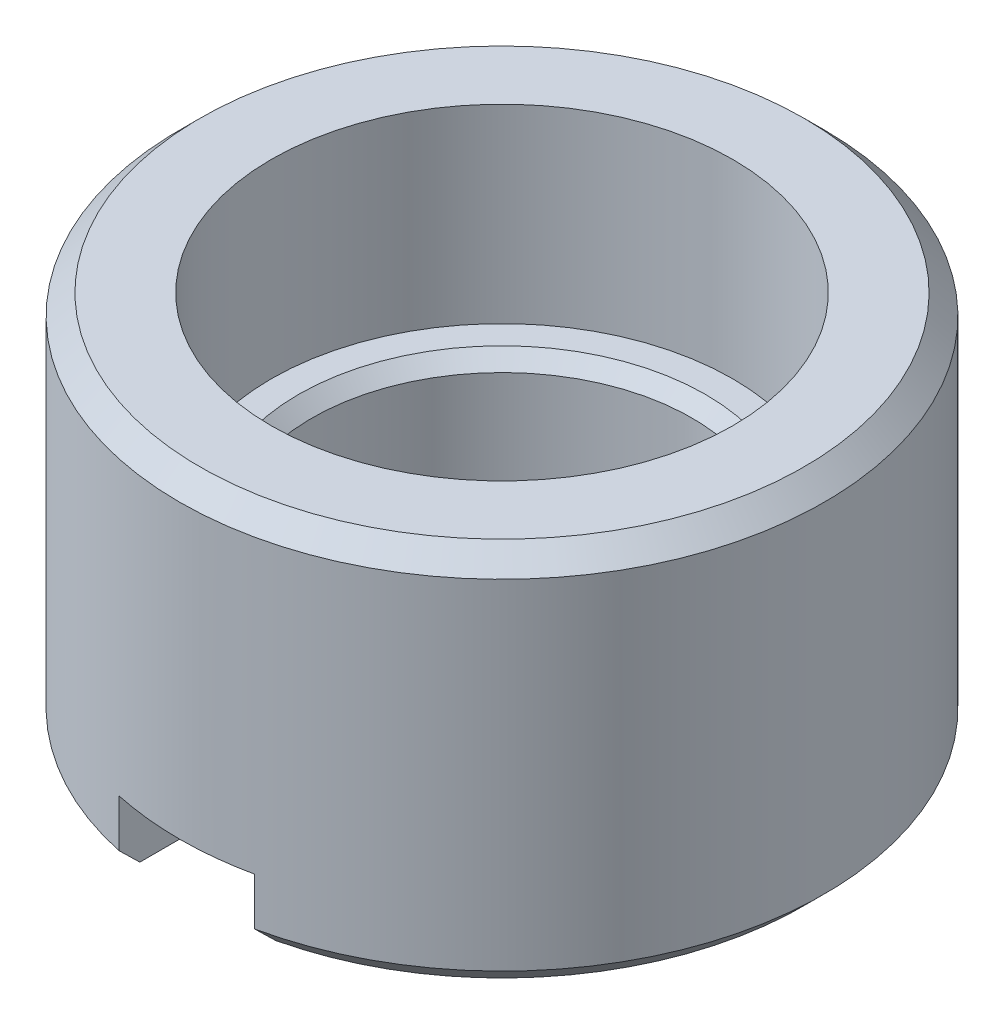
ISO-10303-21;
HEADER;
FILE_DESCRIPTION(('STEP AP214'),'2;1');
FILE_NAME('part.step','',(''),(''),'','','');
FILE_SCHEMA(('AUTOMOTIVE_DESIGN { 1 0 10303 214 1 1 1 1 }'));
ENDSEC;
DATA;
#1=APPLICATION_CONTEXT('core data for automotive mechanical design processes');
#2=APPLICATION_PROTOCOL_DEFINITION('international standard','automotive_design',2000,#1);
#3=PRODUCT_CONTEXT('',#1,'mechanical');
#4=PRODUCT('Part','Part','',(#3));
#5=PRODUCT_RELATED_PRODUCT_CATEGORY('part','',(#4));
#6=PRODUCT_DEFINITION_FORMATION('','',#4);
#7=PRODUCT_DEFINITION_CONTEXT('part definition',#1,'design');
#8=PRODUCT_DEFINITION('design','',#6,#7);
#9=PRODUCT_DEFINITION_SHAPE('','',#8);
#10=(LENGTH_UNIT() NAMED_UNIT(*) SI_UNIT(.MILLI.,.METRE.));
#11=(NAMED_UNIT(*) PLANE_ANGLE_UNIT() SI_UNIT($,.RADIAN.));
#12=(NAMED_UNIT(*) SI_UNIT($,.STERADIAN.) SOLID_ANGLE_UNIT());
#13=UNCERTAINTY_MEASURE_WITH_UNIT(LENGTH_MEASURE(1.E-05),#10,'distance_accuracy_value','');
#14=(GEOMETRIC_REPRESENTATION_CONTEXT(3) GLOBAL_UNCERTAINTY_ASSIGNED_CONTEXT((#13)) GLOBAL_UNIT_ASSIGNED_CONTEXT((#10,
#11,#12)) REPRESENTATION_CONTEXT('',''));
#15=CARTESIAN_POINT('',(0.,0.,0.));
#16=DIRECTION('',(0.,0.,1.));
#17=DIRECTION('',(1.,0.,0.));
#18=AXIS2_PLACEMENT_3D('',#15,#16,#17);
#19=CARTESIAN_POINT('',(0.,1.39999999993279,0.));
#20=DIRECTION('',(0.,1.,0.));
#21=DIRECTION('',(0.,0.,1.));
#22=AXIS2_PLACEMENT_3D('',#19,#20,#21);
#23=CONICAL_SURFACE('',#22,1.49999999990769,0.785398163397448);
#24=CARTESIAN_POINT('',(0.,1.39999999998963,0.));
#25=DIRECTION('',(0.,1.,0.));
#26=DIRECTION('',(0.,0.,1.));
#27=AXIS2_PLACEMENT_3D('',#24,#25,#26);
#28=CIRCLE('',#27,1.49999999996453);
#29=CARTESIAN_POINT('',(0.,1.39999999998963,1.49999999996453));
#30=VERTEX_POINT('',#29);
#31=EDGE_CURVE('E92',#30,#30,#28,.T.);
#32=ORIENTED_EDGE('',*,*,#31,.T.);
#33=EDGE_LOOP('',(#32));
#34=FACE_BOUND('',#33,.T.);
#35=CARTESIAN_POINT('',(0.,1.3,0.));
#36=DIRECTION('',(0.,1.,0.));
#37=DIRECTION('',(0.,0.,1.));
#38=AXIS2_PLACEMENT_3D('',#35,#36,#37);
#39=CIRCLE('',#38,1.4);
#40=CARTESIAN_POINT('',(0.,1.3,1.4));
#41=VERTEX_POINT('',#40);
#42=EDGE_CURVE('E89',#41,#41,#39,.F.);
#43=ORIENTED_EDGE('',*,*,#42,.T.);
#44=EDGE_LOOP('',(#43));
#45=FACE_BOUND('',#44,.T.);
#46=ADVANCED_FACE('F16',(#34,#45),#23,.F.);
#47=CARTESIAN_POINT('',(0.,0.,0.));
#48=DIRECTION('',(0.,1.,0.));
#49=DIRECTION('',(0.,0.,1.));
#50=AXIS2_PLACEMENT_3D('',#47,#48,#49);
#51=CYLINDRICAL_SURFACE('',#50,1.4);
#52=DIRECTION('',(0.,1.,0.));
#53=VECTOR('',#52,1.);
#54=CARTESIAN_POINT('',(-0.500000000000068,0.,1.30766968306218));
#55=LINE('',#54,#53);
#56=CARTESIAN_POINT('',(-0.500000000000034,0.15000000002292,1.30766968310323));
#57=VERTEX_POINT('',#56);
#58=CARTESIAN_POINT('',(-0.500000000000034,0.5,1.30766968306219));
#59=VERTEX_POINT('',#58);
#60=EDGE_CURVE('E65',#57,#59,#55,.T.);
#61=ORIENTED_EDGE('',*,*,#60,.F.);
#62=CARTESIAN_POINT('',(0.,0.15000000001919,0.));
#63=DIRECTION('',(0.,-1.,0.));
#64=DIRECTION('',(0.,0.,-1.));
#65=AXIS2_PLACEMENT_3D('',#62,#63,#64);
#66=CIRCLE('',#65,1.40000000010332);
#67=CARTESIAN_POINT('',(0.500000000000068,0.150000000061254,1.30766968306218));
#68=VERTEX_POINT('',#67);
#69=EDGE_CURVE('E88',#57,#68,#66,.T.);
#70=ORIENTED_EDGE('',*,*,#69,.T.);
#71=DIRECTION('',(0.,1.,0.));
#72=VECTOR('',#71,1.);
#73=CARTESIAN_POINT('',(0.500000000000068,0.,1.30766968306218));
#74=LINE('',#73,#72);
#75=CARTESIAN_POINT('',(0.500000000000034,0.5,1.30766968306219));
#76=VERTEX_POINT('',#75);
#77=EDGE_CURVE('E76',#76,#68,#74,.F.);
#78=ORIENTED_EDGE('',*,*,#77,.F.);
#79=CARTESIAN_POINT('',(0.,0.5,0.));
#80=DIRECTION('',(0.,1.,0.));
#81=DIRECTION('',(0.,0.,1.));
#82=AXIS2_PLACEMENT_3D('',#79,#80,#81);
#83=CIRCLE('',#82,1.4);
#84=EDGE_CURVE('E19',#59,#76,#83,.T.);
#85=ORIENTED_EDGE('',*,*,#84,.F.);
#86=EDGE_LOOP('',(#61,#70,#78,#85));
#87=FACE_BOUND('',#86,.T.);
#88=ORIENTED_EDGE('',*,*,#42,.F.);
#89=EDGE_LOOP('',(#88));
#90=FACE_BOUND('',#89,.T.);
#91=ADVANCED_FACE('F86',(#87,#90),#51,.F.);
#92=CARTESIAN_POINT('',(0.,1.4,0.));
#93=DIRECTION('',(0.,-1.,0.));
#94=DIRECTION('',(0.,0.,-1.));
#95=AXIS2_PLACEMENT_3D('',#92,#93,#94);
#96=PLANE('',#95);
#97=ORIENTED_EDGE('',*,*,#31,.F.);
#98=EDGE_LOOP('',(#97));
#99=FACE_BOUND('',#98,.T.);
#100=CARTESIAN_POINT('',(0.,1.4,0.));
#101=DIRECTION('',(0.,-1.,0.));
#102=DIRECTION('',(0.,0.,-1.));
#103=AXIS2_PLACEMENT_3D('',#100,#101,#102);
#104=CIRCLE('',#103,1.7);
#105=CARTESIAN_POINT('',(0.,1.4,-1.7));
#106=VERTEX_POINT('',#105);
#107=EDGE_CURVE('E150',#106,#106,#104,.F.);
#108=ORIENTED_EDGE('',*,*,#107,.T.);
#109=EDGE_LOOP('',(#108));
#110=FACE_BOUND('',#109,.T.);
#111=ADVANCED_FACE('F160',(#99,#110),#96,.F.);
#112=CARTESIAN_POINT('',(0.,0.,0.));
#113=DIRECTION('',(0.,-1.,0.));
#114=DIRECTION('',(0.,0.,-1.));
#115=AXIS2_PLACEMENT_3D('',#112,#113,#114);
#116=CONICAL_SURFACE('',#115,1.55000000006567,0.78539816320797);
#117=CARTESIAN_POINT('',(0.499999999981814,0.150000000035574,1.30766968313469));
#118=CARTESIAN_POINT('',(0.499999999990907,0.125087850550626,1.33433072214663));
#119=CARTESIAN_POINT('',(0.499999999996969,0.100131774063996,1.36095044282874));
#120=CARTESIAN_POINT('',(0.500000000003031,0.0501317740330847,1.41410724014906));
#121=CARTESIAN_POINT('',(0.500000000003031,0.0250878505132113,1.44064431681023));
#122=CARTESIAN_POINT('',(0.5,1.60643127711289E-11,1.46714007516452));
#123=B_SPLINE_CURVE_WITH_KNOTS('',3,(#117,#118,#119,#120,#121,#122),.UNSPECIFIED.,.F.,.F.,(4,2,
4),(0.,0.10946569117856,0.218931351944436),.UNSPECIFIED.);
#124=CARTESIAN_POINT('',(0.5,8.02214772254536E-12,1.46714007517302));
#125=VERTEX_POINT('',#124);
#126=EDGE_CURVE('E143',#68,#125,#123,.T.);
#127=ORIENTED_EDGE('',*,*,#126,.F.);
#128=ORIENTED_EDGE('',*,*,#69,.F.);
#129=CARTESIAN_POINT('',(-0.499999999994457,1.28525201491322E-11,1.46714007516152));
#130=CARTESIAN_POINT('',(-0.499999999997228,0.0250878505098879,1.44064431680714));
#131=CARTESIAN_POINT('',(-0.499999999999076,0.0501317740308252,1.41410724014697));
#132=CARTESIAN_POINT('',(-0.500000000000924,0.100131774066208,1.36095044283088));
#133=CARTESIAN_POINT('',(-0.500000000000924,0.125087850556246,1.33433072215198));
#134=CARTESIAN_POINT('',(-0.5,0.150000000045777,1.30766968314435));
#135=B_SPLINE_CURVE_WITH_KNOTS('',3,(#129,#130,#131,#132,#133,#134),.UNSPECIFIED.,.F.,.F.,(4,2,
4),(0.,0.10946566076587,0.218931351944392),.UNSPECIFIED.);
#136=CARTESIAN_POINT('',(-0.5,8.02201525868665E-12,1.46714007517302));
#137=VERTEX_POINT('',#136);
#138=EDGE_CURVE('E151',#137,#57,#135,.T.);
#139=ORIENTED_EDGE('',*,*,#138,.F.);
#140=CARTESIAN_POINT('',(0.,0.,0.));
#141=DIRECTION('',(0.,-1.,0.));
#142=DIRECTION('',(0.,0.,-1.));
#143=AXIS2_PLACEMENT_3D('',#140,#141,#142);
#144=CIRCLE('',#143,1.55000000006567);
#145=EDGE_CURVE('E196',#137,#125,#144,.T.);
#146=ORIENTED_EDGE('',*,*,#145,.T.);
#147=EDGE_LOOP('',(#127,#128,#139,#146));
#148=FACE_BOUND('',#147,.T.);
#149=ADVANCED_FACE('F155',(#148),#116,.F.);
#150=CARTESIAN_POINT('',(0.,2.8,0.));
#151=DIRECTION('',(0.,-1.,0.));
#152=DIRECTION('',(0.,0.,-1.));
#153=AXIS2_PLACEMENT_3D('',#150,#151,#152);
#154=CYLINDRICAL_SURFACE('',#153,1.7);
#155=CARTESIAN_POINT('',(0.,2.8,0.));
#156=DIRECTION('',(0.,-1.,0.));
#157=DIRECTION('',(0.,0.,-1.));
#158=AXIS2_PLACEMENT_3D('',#155,#156,#157);
#159=CIRCLE('',#158,1.7);
#160=CARTESIAN_POINT('',(0.,2.8,-1.7));
#161=VERTEX_POINT('',#160);
#162=EDGE_CURVE('E84',#161,#161,#159,.T.);
#163=ORIENTED_EDGE('',*,*,#162,.F.);
#164=EDGE_LOOP('',(#163));
#165=FACE_BOUND('',#164,.T.);
#166=ORIENTED_EDGE('',*,*,#107,.F.);
#167=EDGE_LOOP('',(#166));
#168=FACE_BOUND('',#167,.T.);
#169=ADVANCED_FACE('F159',(#165,#168),#154,.F.);
#170=CARTESIAN_POINT('',(0.,0.,0.));
#171=DIRECTION('',(0.,1.,0.));
#172=DIRECTION('',(0.,0.,1.));
#173=AXIS2_PLACEMENT_3D('',#170,#171,#172);
#174=PLANE('',#173);
#175=DIRECTION('',(0.,0.,1.));
#176=VECTOR('',#175,1.);
#177=CARTESIAN_POINT('',(-0.5,0.,3.));
#178=LINE('',#177,#176);
#179=CARTESIAN_POINT('',(-0.5,-8.84632695322834E-13,2.16809247958665));
#180=VERTEX_POINT('',#179);
#181=EDGE_CURVE('E201',#137,#180,#178,.T.);
#182=ORIENTED_EDGE('',*,*,#181,.T.);
#183=CARTESIAN_POINT('',(0.,0.,0.));
#184=DIRECTION('',(0.,1.,0.));
#185=DIRECTION('',(0.,0.,1.));
#186=AXIS2_PLACEMENT_3D('',#183,#184,#185);
#187=CIRCLE('',#186,2.22500000000991);
#188=CARTESIAN_POINT('',(0.5,0.,2.16809247958756));
#189=VERTEX_POINT('',#188);
#190=EDGE_CURVE('E113',#189,#180,#187,.T.);
#191=ORIENTED_EDGE('',*,*,#190,.F.);
#192=DIRECTION('',(0.,0.,-1.));
#193=VECTOR('',#192,1.);
#194=CARTESIAN_POINT('',(0.5,0.,0.));
#195=LINE('',#194,#193);
#196=EDGE_CURVE('E198',#189,#125,#195,.T.);
#197=ORIENTED_EDGE('',*,*,#196,.T.);
#198=ORIENTED_EDGE('',*,*,#145,.F.);
#199=EDGE_LOOP('',(#182,#191,#197,#198));
#200=FACE_BOUND('',#199,.T.);
#201=ADVANCED_FACE('F139',(#200),#174,.F.);
#202=CARTESIAN_POINT('',(0.5,0.,0.));
#203=DIRECTION('',(1.,0.,0.));
#204=DIRECTION('',(0.,0.,-1.));
#205=AXIS2_PLACEMENT_3D('',#202,#203,#204);
#206=PLANE('',#205);
#207=DIRECTION('',(0.,1.,0.));
#208=VECTOR('',#207,1.);
#209=CARTESIAN_POINT('',(0.499999999999967,0.,2.32177195262585));
#210=LINE('',#209,#208);
#211=CARTESIAN_POINT('',(0.499999999999983,0.5,2.32177195262584));
#212=VERTEX_POINT('',#211);
#213=CARTESIAN_POINT('',(0.499999999999983,0.150000000003367,2.32177195263436));
#214=VERTEX_POINT('',#213);
#215=EDGE_CURVE('E83',#212,#214,#210,.F.);
#216=ORIENTED_EDGE('',*,*,#215,.F.);
#217=DIRECTION('',(0.,0.,-1.));
#218=VECTOR('',#217,1.);
#219=CARTESIAN_POINT('',(0.5,0.5,0.));
#220=LINE('',#219,#218);
#221=EDGE_CURVE('E72',#76,#212,#220,.F.);
#222=ORIENTED_EDGE('',*,*,#221,.F.);
#223=ORIENTED_EDGE('',*,*,#77,.T.);
#224=ORIENTED_EDGE('',*,*,#126,.T.);
#225=ORIENTED_EDGE('',*,*,#196,.F.);
#226=CARTESIAN_POINT('',(0.5,0.150000000006734,2.32177195264287));
#227=CARTESIAN_POINT('',(0.5,0.124979267278892,2.29617894373316));
#228=CARTESIAN_POINT('',(0.5,0.0999689009809356,2.27057581659196));
#229=CARTESIAN_POINT('',(0.5,0.0499689009777126,2.21934932557296));
#230=CARTESIAN_POINT('',(0.5,0.0249792672726675,2.19372596169494));
#231=CARTESIAN_POINT('',(0.5,-2.27022831043389E-12,2.16809247958523));
#232=B_SPLINE_CURVE_WITH_KNOTS('',3,(#226,#227,#228,#229,#230,#231),.UNSPECIFIED.,.F.,.F.,(4,2,
4),(0.,0.107374796278718,0.21474959370455),.UNSPECIFIED.);
#233=EDGE_CURVE('E129',#214,#189,#232,.T.);
#234=ORIENTED_EDGE('',*,*,#233,.F.);
#235=EDGE_LOOP('',(#216,#222,#223,#224,#225,#234));
#236=FACE_BOUND('',#235,.T.);
#237=ADVANCED_FACE('F79',(#236),#206,.F.);
#238=CARTESIAN_POINT('',(-0.5,0.,3.));
#239=DIRECTION('',(-1.,0.,0.));
#240=DIRECTION('',(0.,0.,1.));
#241=AXIS2_PLACEMENT_3D('',#238,#239,#240);
#242=PLANE('',#241);
#243=ORIENTED_EDGE('',*,*,#60,.T.);
#244=DIRECTION('',(0.,0.,-1.));
#245=VECTOR('',#244,1.);
#246=CARTESIAN_POINT('',(-0.5,0.5,0.));
#247=LINE('',#246,#245);
#248=CARTESIAN_POINT('',(-0.499999999999983,0.5,2.32177195262584));
#249=VERTEX_POINT('',#248);
#250=EDGE_CURVE('E34',#249,#59,#247,.T.);
#251=ORIENTED_EDGE('',*,*,#250,.F.);
#252=DIRECTION('',(0.,1.,0.));
#253=VECTOR('',#252,1.);
#254=CARTESIAN_POINT('',(-0.499999999999967,0.,2.32177195262585));
#255=LINE('',#254,#253);
#256=CARTESIAN_POINT('',(-0.499999999999983,0.150000000003367,2.32177195263436));
#257=VERTEX_POINT('',#256);
#258=EDGE_CURVE('E104',#257,#249,#255,.T.);
#259=ORIENTED_EDGE('',*,*,#258,.F.);
#260=CARTESIAN_POINT('',(-0.5,-1.76922929641251E-12,2.16809247958574));
#261=CARTESIAN_POINT('',(-0.5,0.0249792672730852,2.19372596169537));
#262=CARTESIAN_POINT('',(-0.5,0.0499689009780469,2.2193493255733));
#263=CARTESIAN_POINT('',(-0.5,0.099968900981103,2.27057581659213));
#264=CARTESIAN_POINT('',(-0.5,0.124979267278976,2.29617894373324));
#265=CARTESIAN_POINT('',(-0.5,0.150000000006735,2.32177195264287));
#266=B_SPLINE_CURVE_WITH_KNOTS('',3,(#260,#261,#262,#263,#264,#265),.UNSPECIFIED.,.F.,.F.,(4,2,
4),(0.,0.107374797425473,0.214749593703833),.UNSPECIFIED.);
#267=EDGE_CURVE('E105',#180,#257,#266,.T.);
#268=ORIENTED_EDGE('',*,*,#267,.F.);
#269=ORIENTED_EDGE('',*,*,#181,.F.);
#270=ORIENTED_EDGE('',*,*,#138,.T.);
#271=EDGE_LOOP('',(#243,#251,#259,#268,#269,#270));
#272=FACE_BOUND('',#271,.T.);
#273=ADVANCED_FACE('F115',(#272),#242,.F.);
#274=CARTESIAN_POINT('',(0.,0.5,0.));
#275=DIRECTION('',(0.,-1.,0.));
#276=DIRECTION('',(0.,0.,-1.));
#277=AXIS2_PLACEMENT_3D('',#274,#275,#276);
#278=PLANE('',#277);
#279=ORIENTED_EDGE('',*,*,#221,.T.);
#280=CARTESIAN_POINT('',(0.,0.5,0.));
#281=DIRECTION('',(0.,1.,0.));
#282=DIRECTION('',(0.,0.,1.));
#283=AXIS2_PLACEMENT_3D('',#280,#281,#282);
#284=CIRCLE('',#283,2.375);
#285=EDGE_CURVE('E102',#249,#212,#284,.T.);
#286=ORIENTED_EDGE('',*,*,#285,.F.);
#287=ORIENTED_EDGE('',*,*,#250,.T.);
#288=ORIENTED_EDGE('',*,*,#84,.T.);
#289=EDGE_LOOP('',(#279,#286,#287,#288));
#290=FACE_BOUND('',#289,.T.);
#291=ADVANCED_FACE('F71',(#290),#278,.T.);
#292=CARTESIAN_POINT('',(0.,2.8,0.));
#293=DIRECTION('',(0.,1.,0.));
#294=DIRECTION('',(0.,0.,1.));
#295=AXIS2_PLACEMENT_3D('',#292,#293,#294);
#296=PLANE('',#295);
#297=ORIENTED_EDGE('',*,*,#162,.T.);
#298=EDGE_LOOP('',(#297));
#299=FACE_BOUND('',#298,.T.);
#300=CARTESIAN_POINT('',(0.,2.79999999992242,0.));
#301=DIRECTION('',(0.,-1.,0.));
#302=DIRECTION('',(0.,0.,-1.));
#303=AXIS2_PLACEMENT_3D('',#300,#301,#302);
#304=CIRCLE('',#303,2.22500000000991);
#305=CARTESIAN_POINT('',(0.,2.79999999992242,-2.22500000000991));
#306=VERTEX_POINT('',#305);
#307=EDGE_CURVE('E99',#306,#306,#304,.T.);
#308=ORIENTED_EDGE('',*,*,#307,.F.);
#309=EDGE_LOOP('',(#308));
#310=FACE_BOUND('',#309,.T.);
#311=ADVANCED_FACE('F125',(#299,#310),#296,.T.);
#312=CARTESIAN_POINT('',(0.,0.149999999962347,0.));
#313=DIRECTION('',(0.,1.,0.));
#314=DIRECTION('',(0.,0.,1.));
#315=AXIS2_PLACEMENT_3D('',#312,#313,#314);
#316=CONICAL_SURFACE('',#315,2.37499999997226,0.785398163397448);
#317=ORIENTED_EDGE('',*,*,#267,.T.);
#318=CARTESIAN_POINT('',(0.,0.15,0.));
#319=DIRECTION('',(0.,1.,0.));
#320=DIRECTION('',(0.,0.,1.));
#321=AXIS2_PLACEMENT_3D('',#318,#319,#320);
#322=CIRCLE('',#321,2.375);
#323=EDGE_CURVE('E25',#214,#257,#322,.T.);
#324=ORIENTED_EDGE('',*,*,#323,.F.);
#325=ORIENTED_EDGE('',*,*,#233,.T.);
#326=ORIENTED_EDGE('',*,*,#190,.T.);
#327=EDGE_LOOP('',(#317,#324,#325,#326));
#328=FACE_BOUND('',#327,.T.);
#329=ADVANCED_FACE('F119',(#328),#316,.T.);
#330=CARTESIAN_POINT('',(0.,2.65000000007376,0.));
#331=DIRECTION('',(0.,-1.,0.));
#332=DIRECTION('',(0.,0.,-1.));
#333=AXIS2_PLACEMENT_3D('',#330,#331,#332);
#334=CONICAL_SURFACE('',#333,2.37499999985857,0.785398163397448);
#335=CARTESIAN_POINT('',(0.,2.65,0.));
#336=DIRECTION('',(0.,1.,0.));
#337=DIRECTION('',(0.,0.,1.));
#338=AXIS2_PLACEMENT_3D('',#335,#336,#337);
#339=CIRCLE('',#338,2.375);
#340=CARTESIAN_POINT('',(0.,2.65,2.375));
#341=VERTEX_POINT('',#340);
#342=EDGE_CURVE('E11',#341,#341,#339,.F.);
#343=ORIENTED_EDGE('',*,*,#342,.F.);
#344=EDGE_LOOP('',(#343));
#345=FACE_BOUND('',#344,.T.);
#346=ORIENTED_EDGE('',*,*,#307,.T.);
#347=EDGE_LOOP('',(#346));
#348=FACE_BOUND('',#347,.T.);
#349=ADVANCED_FACE('F124',(#345,#348),#334,.T.);
#350=CARTESIAN_POINT('',(0.,0.,0.));
#351=DIRECTION('',(0.,1.,0.));
#352=DIRECTION('',(0.,0.,1.));
#353=AXIS2_PLACEMENT_3D('',#350,#351,#352);
#354=CYLINDRICAL_SURFACE('',#353,2.375);
#355=ORIENTED_EDGE('',*,*,#215,.T.);
#356=ORIENTED_EDGE('',*,*,#323,.T.);
#357=ORIENTED_EDGE('',*,*,#258,.T.);
#358=ORIENTED_EDGE('',*,*,#285,.T.);
#359=EDGE_LOOP('',(#355,#356,#357,#358));
#360=FACE_BOUND('',#359,.T.);
#361=ORIENTED_EDGE('',*,*,#342,.T.);
#362=EDGE_LOOP('',(#361));
#363=FACE_BOUND('',#362,.T.);
#364=ADVANCED_FACE('F171',(#360,#363),#354,.T.);
#365=CLOSED_SHELL('',(#46,#91,#111,#149,#169,#201,#237,#273,#291,#311,#329,#349,#364));
#366=MANIFOLD_SOLID_BREP('B1',#365);
#367=ADVANCED_BREP_SHAPE_REPRESENTATION('',(#18,#366),#14);
#368=SHAPE_DEFINITION_REPRESENTATION(#9,#367);
ENDSEC;
END-ISO-10303-21;
